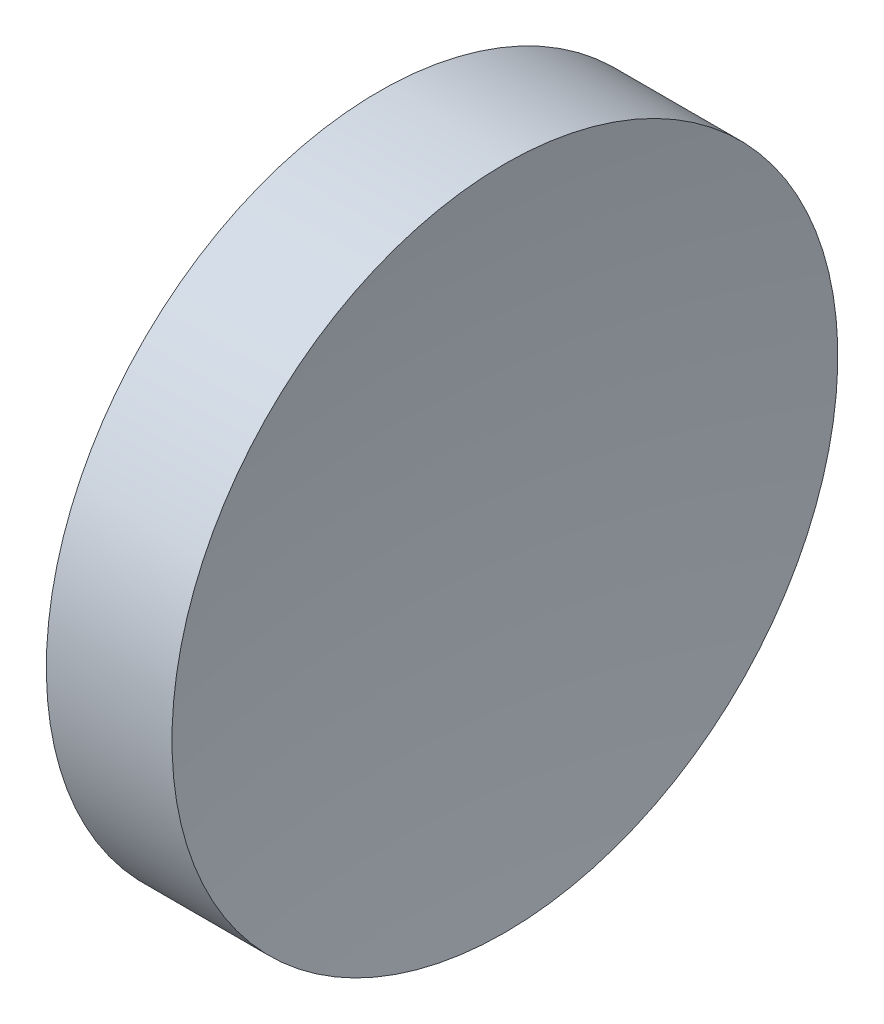
ISO-10303-21;
HEADER;
FILE_DESCRIPTION(('STEP AP214'),'2;1');
FILE_NAME('part.step','',(''),(''),'','','');
FILE_SCHEMA(('AUTOMOTIVE_DESIGN { 1 0 10303 214 1 1 1 1 }'));
ENDSEC;
DATA;
#1=APPLICATION_CONTEXT('core data for automotive mechanical design processes');
#2=APPLICATION_PROTOCOL_DEFINITION('international standard','automotive_design',2000,#1);
#3=PRODUCT_CONTEXT('',#1,'mechanical');
#4=PRODUCT('Part','Part','',(#3));
#5=PRODUCT_RELATED_PRODUCT_CATEGORY('part','',(#4));
#6=PRODUCT_DEFINITION_FORMATION('','',#4);
#7=PRODUCT_DEFINITION_CONTEXT('part definition',#1,'design');
#8=PRODUCT_DEFINITION('design','',#6,#7);
#9=PRODUCT_DEFINITION_SHAPE('','',#8);
#10=(LENGTH_UNIT() NAMED_UNIT(*) SI_UNIT(.MILLI.,.METRE.));
#11=(NAMED_UNIT(*) PLANE_ANGLE_UNIT() SI_UNIT($,.RADIAN.));
#12=(NAMED_UNIT(*) SI_UNIT($,.STERADIAN.) SOLID_ANGLE_UNIT());
#13=UNCERTAINTY_MEASURE_WITH_UNIT(LENGTH_MEASURE(1.E-05),#10,'distance_accuracy_value','');
#14=(GEOMETRIC_REPRESENTATION_CONTEXT(3) GLOBAL_UNCERTAINTY_ASSIGNED_CONTEXT((#13)) GLOBAL_UNIT_ASSIGNED_CONTEXT((#10,
#11,#12)) REPRESENTATION_CONTEXT('',''));
#15=CARTESIAN_POINT('',(0.,0.,0.));
#16=DIRECTION('',(0.,0.,1.));
#17=DIRECTION('',(1.,0.,0.));
#18=AXIS2_PLACEMENT_3D('',#15,#16,#17);
#19=CARTESIAN_POINT('',(56.4242320536207,13.031126091403,0.));
#20=DIRECTION('',(-1.,0.,0.));
#21=DIRECTION('',(0.,1.,0.));
#22=AXIS2_PLACEMENT_3D('',#19,#20,#21);
#23=SPHERICAL_SURFACE('',#22,32.5);
#24=CARTESIAN_POINT('',(24.3111506069578,13.031126091403,0.));
#25=DIRECTION('',(-1.,0.,0.));
#26=DIRECTION('',(0.,-1.,0.));
#27=AXIS2_PLACEMENT_3D('',#24,#25,#26);
#28=CIRCLE('',#27,5.);
#29=CARTESIAN_POINT('',(24.3111506069578,8.03112609140304,0.));
#30=VERTEX_POINT('',#29);
#31=EDGE_CURVE('E10',#30,#30,#28,.T.);
#32=ORIENTED_EDGE('',*,*,#31,.F.);
#33=EDGE_LOOP('',(#32));
#34=FACE_BOUND('',#33,.T.);
#35=ADVANCED_FACE('F35',(#34),#23,.F.);
#36=CARTESIAN_POINT('',(21.5059751180825,13.031126091403,0.));
#37=DIRECTION('',(-1.,0.,0.));
#38=DIRECTION('',(0.,-1.,0.));
#39=AXIS2_PLACEMENT_3D('',#36,#37,#38);
#40=CYLINDRICAL_SURFACE('',#39,5.);
#41=CARTESIAN_POINT('',(22.4242320536207,13.031126091403,0.));
#42=DIRECTION('',(-1.,0.,0.));
#43=DIRECTION('',(0.,-1.,0.));
#44=AXIS2_PLACEMENT_3D('',#41,#42,#43);
#45=CIRCLE('',#44,5.);
#46=CARTESIAN_POINT('',(22.4242320536207,8.03112609140304,0.));
#47=VERTEX_POINT('',#46);
#48=EDGE_CURVE('E41',#47,#47,#45,.T.);
#49=ORIENTED_EDGE('',*,*,#48,.F.);
#50=EDGE_LOOP('',(#49));
#51=FACE_BOUND('',#50,.T.);
#52=ORIENTED_EDGE('',*,*,#31,.T.);
#53=EDGE_LOOP('',(#52));
#54=FACE_BOUND('',#53,.T.);
#55=ADVANCED_FACE('F49',(#51,#54),#40,.T.);
#56=CARTESIAN_POINT('',(22.4242320536207,13.031126091403,0.));
#57=DIRECTION('',(1.,0.,0.));
#58=DIRECTION('',(0.,1.,0.));
#59=AXIS2_PLACEMENT_3D('',#56,#57,#58);
#60=PLANE('',#59);
#61=ORIENTED_EDGE('',*,*,#48,.T.);
#62=EDGE_LOOP('',(#61));
#63=FACE_BOUND('',#62,.T.);
#64=ADVANCED_FACE('F47',(#63),#60,.F.);
#65=CLOSED_SHELL('',(#35,#55,#64));
#66=MANIFOLD_SOLID_BREP('B2',#65);
#67=ADVANCED_BREP_SHAPE_REPRESENTATION('',(#18,#66),#14);
#68=SHAPE_DEFINITION_REPRESENTATION(#9,#67);
ENDSEC;
END-ISO-10303-21;
